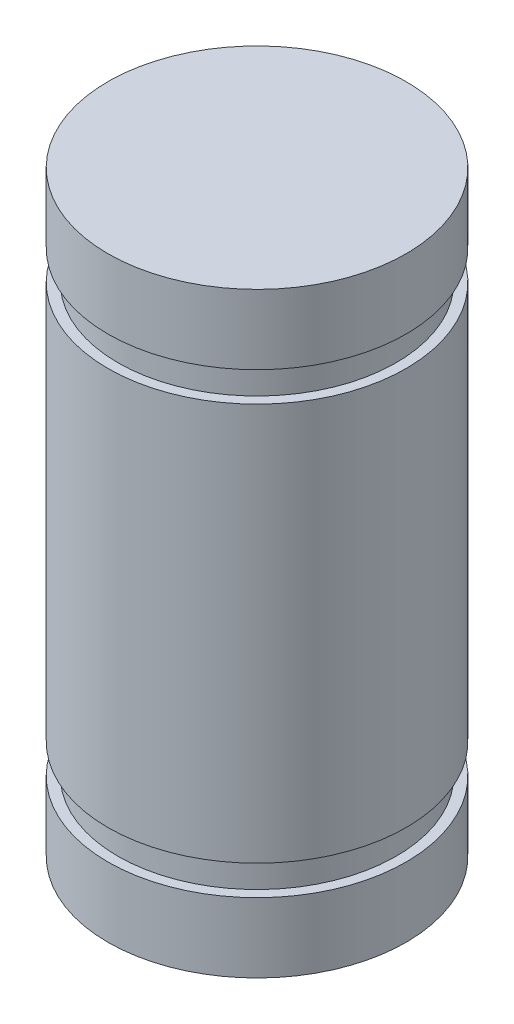
ISO-10303-21;
HEADER;
FILE_DESCRIPTION(('STEP AP214'),'2;1');
FILE_NAME('part.step','',(''),(''),'','','');
FILE_SCHEMA(('AUTOMOTIVE_DESIGN { 1 0 10303 214 1 1 1 1 }'));
ENDSEC;
DATA;
#1=APPLICATION_CONTEXT('core data for automotive mechanical design processes');
#2=APPLICATION_PROTOCOL_DEFINITION('international standard','automotive_design',2000,#1);
#3=PRODUCT_CONTEXT('',#1,'mechanical');
#4=PRODUCT('Part','Part','',(#3));
#5=PRODUCT_RELATED_PRODUCT_CATEGORY('part','',(#4));
#6=PRODUCT_DEFINITION_FORMATION('','',#4);
#7=PRODUCT_DEFINITION_CONTEXT('part definition',#1,'design');
#8=PRODUCT_DEFINITION('design','',#6,#7);
#9=PRODUCT_DEFINITION_SHAPE('','',#8);
#10=(LENGTH_UNIT() NAMED_UNIT(*) SI_UNIT(.MILLI.,.METRE.));
#11=(NAMED_UNIT(*) PLANE_ANGLE_UNIT() SI_UNIT($,.RADIAN.));
#12=(NAMED_UNIT(*) SI_UNIT($,.STERADIAN.) SOLID_ANGLE_UNIT());
#13=UNCERTAINTY_MEASURE_WITH_UNIT(LENGTH_MEASURE(1.E-05),#10,'distance_accuracy_value','');
#14=(GEOMETRIC_REPRESENTATION_CONTEXT(3) GLOBAL_UNCERTAINTY_ASSIGNED_CONTEXT((#13)) GLOBAL_UNIT_ASSIGNED_CONTEXT((#10,
#11,#12)) REPRESENTATION_CONTEXT('',''));
#15=CARTESIAN_POINT('',(0.,0.,0.));
#16=DIRECTION('',(0.,0.,1.));
#17=DIRECTION('',(1.,0.,0.));
#18=AXIS2_PLACEMENT_3D('',#15,#16,#17);
#19=CARTESIAN_POINT('',(0.,6.,0.));
#20=DIRECTION('',(0.,1.,0.));
#21=DIRECTION('',(0.,0.,1.));
#22=AXIS2_PLACEMENT_3D('',#19,#20,#21);
#23=CYLINDRICAL_SURFACE('',#22,3.);
#24=CARTESIAN_POINT('',(0.,-4.6,0.));
#25=DIRECTION('',(0.,1.,0.));
#26=DIRECTION('',(0.,0.,1.));
#27=AXIS2_PLACEMENT_3D('',#24,#25,#26);
#28=CIRCLE('',#27,3.);
#29=CARTESIAN_POINT('',(0.,-4.6,3.));
#30=VERTEX_POINT('',#29);
#31=EDGE_CURVE('E10',#30,#30,#28,.T.);
#32=ORIENTED_EDGE('',*,*,#31,.F.);
#33=EDGE_LOOP('',(#32));
#34=FACE_BOUND('',#33,.T.);
#35=CARTESIAN_POINT('',(0.,-6.,0.));
#36=DIRECTION('',(0.,1.,0.));
#37=DIRECTION('',(0.,0.,1.));
#38=AXIS2_PLACEMENT_3D('',#35,#36,#37);
#39=CIRCLE('',#38,3.);
#40=CARTESIAN_POINT('',(0.,-6.,3.));
#41=VERTEX_POINT('',#40);
#42=EDGE_CURVE('E79',#41,#41,#39,.T.);
#43=ORIENTED_EDGE('',*,*,#42,.T.);
#44=EDGE_LOOP('',(#43));
#45=FACE_BOUND('',#44,.T.);
#46=ADVANCED_FACE('F34',(#34,#45),#23,.T.);
#47=CARTESIAN_POINT('',(3.,-4.6,0.));
#48=DIRECTION('',(0.,-1.,0.));
#49=DIRECTION('',(0.,0.,-1.));
#50=AXIS2_PLACEMENT_3D('',#47,#48,#49);
#51=PLANE('',#50);
#52=CARTESIAN_POINT('',(0.,-4.6,0.));
#53=DIRECTION('',(0.,1.,0.));
#54=DIRECTION('',(0.,0.,1.));
#55=AXIS2_PLACEMENT_3D('',#52,#53,#54);
#56=CIRCLE('',#55,2.8);
#57=CARTESIAN_POINT('',(0.,-4.6,2.8));
#58=VERTEX_POINT('',#57);
#59=EDGE_CURVE('E41',#58,#58,#56,.T.);
#60=ORIENTED_EDGE('',*,*,#59,.F.);
#61=EDGE_LOOP('',(#60));
#62=FACE_BOUND('',#61,.T.);
#63=ORIENTED_EDGE('',*,*,#31,.T.);
#64=EDGE_LOOP('',(#63));
#65=FACE_BOUND('',#64,.T.);
#66=ADVANCED_FACE('F98',(#62,#65),#51,.F.);
#67=CARTESIAN_POINT('',(0.,6.,0.));
#68=DIRECTION('',(0.,1.,0.));
#69=DIRECTION('',(0.,0.,1.));
#70=AXIS2_PLACEMENT_3D('',#67,#68,#69);
#71=CYLINDRICAL_SURFACE('',#70,2.8);
#72=CARTESIAN_POINT('',(0.,-4.,0.));
#73=DIRECTION('',(0.,1.,0.));
#74=DIRECTION('',(0.,0.,1.));
#75=AXIS2_PLACEMENT_3D('',#72,#73,#74);
#76=CIRCLE('',#75,2.8);
#77=CARTESIAN_POINT('',(0.,-4.,2.8));
#78=VERTEX_POINT('',#77);
#79=EDGE_CURVE('E49',#78,#78,#76,.T.);
#80=ORIENTED_EDGE('',*,*,#79,.F.);
#81=EDGE_LOOP('',(#80));
#82=FACE_BOUND('',#81,.T.);
#83=ORIENTED_EDGE('',*,*,#59,.T.);
#84=EDGE_LOOP('',(#83));
#85=FACE_BOUND('',#84,.T.);
#86=ADVANCED_FACE('F102',(#82,#85),#71,.T.);
#87=CARTESIAN_POINT('',(2.8,-4.,0.));
#88=DIRECTION('',(0.,1.,0.));
#89=DIRECTION('',(0.,0.,1.));
#90=AXIS2_PLACEMENT_3D('',#87,#88,#89);
#91=PLANE('',#90);
#92=CARTESIAN_POINT('',(0.,-4.,0.));
#93=DIRECTION('',(0.,1.,0.));
#94=DIRECTION('',(0.,0.,1.));
#95=AXIS2_PLACEMENT_3D('',#92,#93,#94);
#96=CIRCLE('',#95,3.);
#97=CARTESIAN_POINT('',(0.,-4.,3.));
#98=VERTEX_POINT('',#97);
#99=EDGE_CURVE('E55',#98,#98,#96,.T.);
#100=ORIENTED_EDGE('',*,*,#99,.F.);
#101=EDGE_LOOP('',(#100));
#102=FACE_BOUND('',#101,.T.);
#103=ORIENTED_EDGE('',*,*,#79,.T.);
#104=EDGE_LOOP('',(#103));
#105=FACE_BOUND('',#104,.T.);
#106=ADVANCED_FACE('F107',(#102,#105),#91,.F.);
#107=CARTESIAN_POINT('',(0.,6.,0.));
#108=DIRECTION('',(0.,1.,0.));
#109=DIRECTION('',(0.,0.,1.));
#110=AXIS2_PLACEMENT_3D('',#107,#108,#109);
#111=CYLINDRICAL_SURFACE('',#110,3.);
#112=CARTESIAN_POINT('',(0.,4.,0.));
#113=DIRECTION('',(0.,1.,0.));
#114=DIRECTION('',(0.,0.,1.));
#115=AXIS2_PLACEMENT_3D('',#112,#113,#114);
#116=CIRCLE('',#115,3.);
#117=CARTESIAN_POINT('',(0.,4.,3.));
#118=VERTEX_POINT('',#117);
#119=EDGE_CURVE('E60',#118,#118,#116,.T.);
#120=ORIENTED_EDGE('',*,*,#119,.F.);
#121=EDGE_LOOP('',(#120));
#122=FACE_BOUND('',#121,.T.);
#123=ORIENTED_EDGE('',*,*,#99,.T.);
#124=EDGE_LOOP('',(#123));
#125=FACE_BOUND('',#124,.T.);
#126=ADVANCED_FACE('F113',(#122,#125),#111,.T.);
#127=CARTESIAN_POINT('',(3.,4.,0.));
#128=DIRECTION('',(0.,-1.,0.));
#129=DIRECTION('',(0.,0.,-1.));
#130=AXIS2_PLACEMENT_3D('',#127,#128,#129);
#131=PLANE('',#130);
#132=CARTESIAN_POINT('',(0.,4.,0.));
#133=DIRECTION('',(0.,1.,0.));
#134=DIRECTION('',(0.,0.,1.));
#135=AXIS2_PLACEMENT_3D('',#132,#133,#134);
#136=CIRCLE('',#135,2.8);
#137=CARTESIAN_POINT('',(0.,4.,2.8));
#138=VERTEX_POINT('',#137);
#139=EDGE_CURVE('E64',#138,#138,#136,.T.);
#140=ORIENTED_EDGE('',*,*,#139,.F.);
#141=EDGE_LOOP('',(#140));
#142=FACE_BOUND('',#141,.T.);
#143=ORIENTED_EDGE('',*,*,#119,.T.);
#144=EDGE_LOOP('',(#143));
#145=FACE_BOUND('',#144,.T.);
#146=ADVANCED_FACE('F117',(#142,#145),#131,.F.);
#147=CARTESIAN_POINT('',(0.,6.,0.));
#148=DIRECTION('',(0.,1.,0.));
#149=DIRECTION('',(0.,0.,1.));
#150=AXIS2_PLACEMENT_3D('',#147,#148,#149);
#151=CYLINDRICAL_SURFACE('',#150,2.8);
#152=CARTESIAN_POINT('',(0.,4.6,0.));
#153=DIRECTION('',(0.,1.,0.));
#154=DIRECTION('',(0.,0.,1.));
#155=AXIS2_PLACEMENT_3D('',#152,#153,#154);
#156=CIRCLE('',#155,2.8);
#157=CARTESIAN_POINT('',(0.,4.6,2.8));
#158=VERTEX_POINT('',#157);
#159=EDGE_CURVE('E68',#158,#158,#156,.T.);
#160=ORIENTED_EDGE('',*,*,#159,.F.);
#161=EDGE_LOOP('',(#160));
#162=FACE_BOUND('',#161,.T.);
#163=ORIENTED_EDGE('',*,*,#139,.T.);
#164=EDGE_LOOP('',(#163));
#165=FACE_BOUND('',#164,.T.);
#166=ADVANCED_FACE('F121',(#162,#165),#151,.T.);
#167=CARTESIAN_POINT('',(2.8,4.6,0.));
#168=DIRECTION('',(0.,1.,0.));
#169=DIRECTION('',(0.,0.,1.));
#170=AXIS2_PLACEMENT_3D('',#167,#168,#169);
#171=PLANE('',#170);
#172=CARTESIAN_POINT('',(0.,4.6,0.));
#173=DIRECTION('',(0.,1.,0.));
#174=DIRECTION('',(0.,0.,1.));
#175=AXIS2_PLACEMENT_3D('',#172,#173,#174);
#176=CIRCLE('',#175,3.);
#177=CARTESIAN_POINT('',(0.,4.6,3.));
#178=VERTEX_POINT('',#177);
#179=EDGE_CURVE('E71',#178,#178,#176,.T.);
#180=ORIENTED_EDGE('',*,*,#179,.F.);
#181=EDGE_LOOP('',(#180));
#182=FACE_BOUND('',#181,.T.);
#183=ORIENTED_EDGE('',*,*,#159,.T.);
#184=EDGE_LOOP('',(#183));
#185=FACE_BOUND('',#184,.T.);
#186=ADVANCED_FACE('F125',(#182,#185),#171,.F.);
#187=CARTESIAN_POINT('',(0.,6.,0.));
#188=DIRECTION('',(0.,1.,0.));
#189=DIRECTION('',(0.,0.,1.));
#190=AXIS2_PLACEMENT_3D('',#187,#188,#189);
#191=CYLINDRICAL_SURFACE('',#190,3.);
#192=CARTESIAN_POINT('',(0.,6.,0.));
#193=DIRECTION('',(0.,1.,0.));
#194=DIRECTION('',(0.,0.,1.));
#195=AXIS2_PLACEMENT_3D('',#192,#193,#194);
#196=CIRCLE('',#195,3.);
#197=CARTESIAN_POINT('',(0.,6.,3.));
#198=VERTEX_POINT('',#197);
#199=EDGE_CURVE('E75',#198,#198,#196,.T.);
#200=ORIENTED_EDGE('',*,*,#199,.F.);
#201=EDGE_LOOP('',(#200));
#202=FACE_BOUND('',#201,.T.);
#203=ORIENTED_EDGE('',*,*,#179,.T.);
#204=EDGE_LOOP('',(#203));
#205=FACE_BOUND('',#204,.T.);
#206=ADVANCED_FACE('F94',(#202,#205),#191,.T.);
#207=CARTESIAN_POINT('',(3.,6.,0.));
#208=DIRECTION('',(0.,-1.,0.));
#209=DIRECTION('',(0.,0.,-1.));
#210=AXIS2_PLACEMENT_3D('',#207,#208,#209);
#211=PLANE('',#210);
#212=ORIENTED_EDGE('',*,*,#199,.T.);
#213=EDGE_LOOP('',(#212));
#214=FACE_BOUND('',#213,.T.);
#215=ADVANCED_FACE('F89',(#214),#211,.F.);
#216=CARTESIAN_POINT('',(0.,-6.,0.));
#217=DIRECTION('',(0.,1.,0.));
#218=DIRECTION('',(0.,0.,1.));
#219=AXIS2_PLACEMENT_3D('',#216,#217,#218);
#220=PLANE('',#219);
#221=ORIENTED_EDGE('',*,*,#42,.F.);
#222=EDGE_LOOP('',(#221));
#223=FACE_BOUND('',#222,.T.);
#224=ADVANCED_FACE('F87',(#223),#220,.F.);
#225=CLOSED_SHELL('',(#46,#66,#86,#106,#126,#146,#166,#186,#206,#215,#224));
#226=MANIFOLD_SOLID_BREP('B2',#225);
#227=ADVANCED_BREP_SHAPE_REPRESENTATION('',(#18,#226),#14);
#228=SHAPE_DEFINITION_REPRESENTATION(#9,#227);
ENDSEC;
END-ISO-10303-21;
